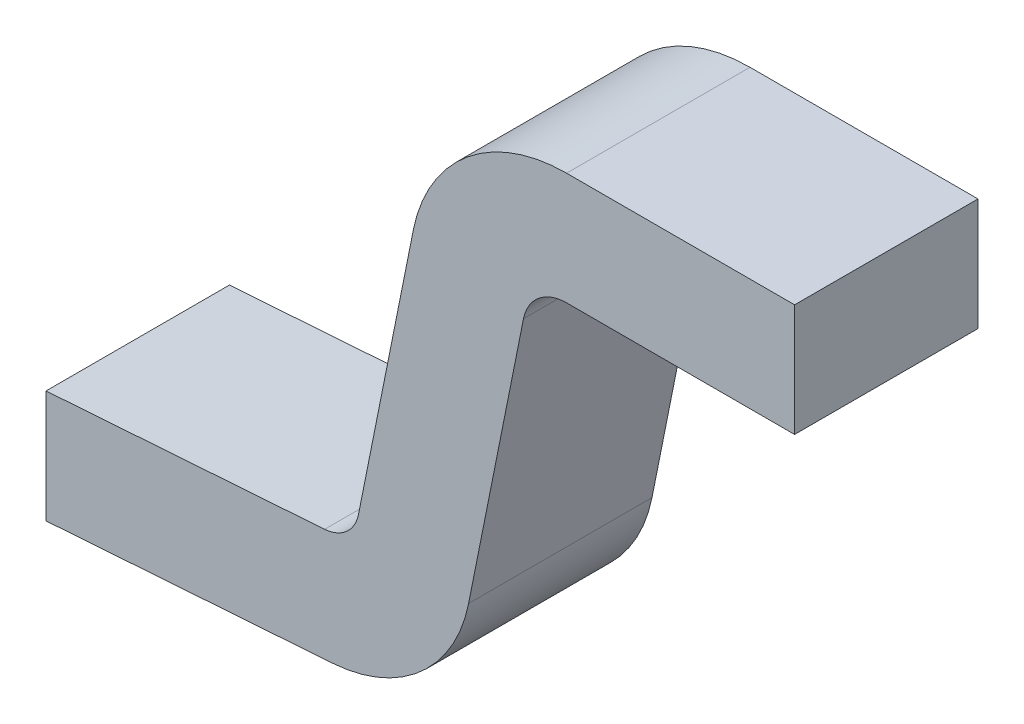
ISO-10303-21;
HEADER;
FILE_DESCRIPTION(('STEP AP214'),'2;1');
FILE_NAME('part.step','',(''),(''),'','','');
FILE_SCHEMA(('AUTOMOTIVE_DESIGN { 1 0 10303 214 1 1 1 1 }'));
ENDSEC;
DATA;
#1=APPLICATION_CONTEXT('core data for automotive mechanical design processes');
#2=APPLICATION_PROTOCOL_DEFINITION('international standard','automotive_design',2000,#1);
#3=PRODUCT_CONTEXT('',#1,'mechanical');
#4=PRODUCT('Part','Part','',(#3));
#5=PRODUCT_RELATED_PRODUCT_CATEGORY('part','',(#4));
#6=PRODUCT_DEFINITION_FORMATION('','',#4);
#7=PRODUCT_DEFINITION_CONTEXT('part definition',#1,'design');
#8=PRODUCT_DEFINITION('design','',#6,#7);
#9=PRODUCT_DEFINITION_SHAPE('','',#8);
#10=(LENGTH_UNIT() NAMED_UNIT(*) SI_UNIT(.MILLI.,.METRE.));
#11=(NAMED_UNIT(*) PLANE_ANGLE_UNIT() SI_UNIT($,.RADIAN.));
#12=(NAMED_UNIT(*) SI_UNIT($,.STERADIAN.) SOLID_ANGLE_UNIT());
#13=UNCERTAINTY_MEASURE_WITH_UNIT(LENGTH_MEASURE(1.E-05),#10,'distance_accuracy_value','');
#14=(GEOMETRIC_REPRESENTATION_CONTEXT(3) GLOBAL_UNCERTAINTY_ASSIGNED_CONTEXT((#13)) GLOBAL_UNIT_ASSIGNED_CONTEXT((#10,
#11,#12)) REPRESENTATION_CONTEXT('',''));
#15=CARTESIAN_POINT('',(0.,0.,0.));
#16=DIRECTION('',(0.,0.,1.));
#17=DIRECTION('',(1.,0.,0.));
#18=AXIS2_PLACEMENT_3D('',#15,#16,#17);
#19=CARTESIAN_POINT('',(-0.127804391765579,-0.198607262984615,0.));
#20=DIRECTION('',(-0.069756473744126,0.997564050259824,0.));
#21=DIRECTION('',(-0.997564050259824,-0.069756473744126,0.));
#22=AXIS2_PLACEMENT_3D('',#19,#20,#21);
#23=PLANE('',#22);
#24=DIRECTION('',(-0.997564050259824,-0.069756473744126,0.));
#25=VECTOR('',#24,1.);
#26=CARTESIAN_POINT('',(-0.127804391765579,-0.198607262984615,0.));
#27=LINE('',#26,#25);
#28=CARTESIAN_POINT('',(-0.127804391765579,-0.198607262984615,0.));
#29=VERTEX_POINT('',#28);
#30=CARTESIAN_POINT('',(-0.5,-0.224633715287824,0.));
#31=VERTEX_POINT('',#30);
#32=EDGE_CURVE('E11',#29,#31,#27,.T.);
#33=ORIENTED_EDGE('',*,*,#32,.T.);
#34=DIRECTION('',(0.,0.,1.));
#35=VECTOR('',#34,1.);
#36=CARTESIAN_POINT('',(-0.5,-0.224633715287824,0.));
#37=LINE('',#36,#35);
#38=CARTESIAN_POINT('',(-0.5,-0.224633715287824,0.245));
#39=VERTEX_POINT('',#38);
#40=EDGE_CURVE('E23',#31,#39,#37,.T.);
#41=ORIENTED_EDGE('',*,*,#40,.T.);
#42=DIRECTION('',(-0.997564050259824,-0.069756473744126,0.));
#43=VECTOR('',#42,1.);
#44=CARTESIAN_POINT('',(-0.127804391765579,-0.198607262984615,0.245));
#45=LINE('',#44,#43);
#46=CARTESIAN_POINT('',(-0.127804391765579,-0.198607262984615,0.245));
#47=VERTEX_POINT('',#46);
#48=EDGE_CURVE('E205',#47,#39,#45,.T.);
#49=ORIENTED_EDGE('',*,*,#48,.F.);
#50=DIRECTION('',(0.,0.,1.));
#51=VECTOR('',#50,1.);
#52=CARTESIAN_POINT('',(-0.127804391765579,-0.198607262984615,0.));
#53=LINE('',#52,#51);
#54=EDGE_CURVE('E202',#29,#47,#53,.T.);
#55=ORIENTED_EDGE('',*,*,#54,.F.);
#56=EDGE_LOOP('',(#33,#41,#49,#55));
#57=FACE_BOUND('',#56,.T.);
#58=ADVANCED_FACE('F16',(#57),#23,.T.);
#59=CARTESIAN_POINT('',(-0.131269254830082,-0.149057412673945,0.));
#60=DIRECTION('',(0.,0.,1.));
#61=DIRECTION('',(-0.069756473744126,0.997564050259824,0.));
#62=AXIS2_PLACEMENT_3D('',#59,#60,#61);
#63=CYLINDRICAL_SURFACE('',#62,0.0496708459950664);
#64=CARTESIAN_POINT('',(-0.131269254830082,-0.149057412673945,0.));
#65=DIRECTION('',(0.,0.,-1.));
#66=DIRECTION('',(-0.069756473744126,0.997564050259824,0.));
#67=AXIS2_PLACEMENT_3D('',#64,#65,#66);
#68=CIRCLE('',#67,0.0496708459950664);
#69=CARTESIAN_POINT('',(-0.0825658942513528,-0.158813211472806,0.));
#70=VERTEX_POINT('',#69);
#71=EDGE_CURVE('E199',#70,#29,#68,.T.);
#72=ORIENTED_EDGE('',*,*,#71,.T.);
#73=ORIENTED_EDGE('',*,*,#54,.T.);
#74=CARTESIAN_POINT('',(-0.131269254830082,-0.149057412673945,0.245));
#75=DIRECTION('',(0.,0.,-1.));
#76=DIRECTION('',(-0.069756473744126,0.997564050259824,0.));
#77=AXIS2_PLACEMENT_3D('',#74,#75,#76);
#78=CIRCLE('',#77,0.0496708459950664);
#79=CARTESIAN_POINT('',(-0.0825658942513528,-0.158813211472806,0.245));
#80=VERTEX_POINT('',#79);
#81=EDGE_CURVE('E196',#80,#47,#78,.T.);
#82=ORIENTED_EDGE('',*,*,#81,.F.);
#83=DIRECTION('',(0.,0.,1.));
#84=VECTOR('',#83,1.);
#85=CARTESIAN_POINT('',(-0.0825658942513528,-0.158813211472806,0.));
#86=LINE('',#85,#84);
#87=EDGE_CURVE('E194',#70,#80,#86,.T.);
#88=ORIENTED_EDGE('',*,*,#87,.F.);
#89=EDGE_LOOP('',(#72,#73,#82,#88));
#90=FACE_BOUND('',#89,.T.);
#91=ADVANCED_FACE('F234',(#90),#63,.F.);
#92=CARTESIAN_POINT('',(-0.00923430841156182,0.207276202690008,0.));
#93=DIRECTION('',(-0.980522066879372,0.196408951839279,0.));
#94=DIRECTION('',(-0.196408951839279,-0.980522066879372,0.));
#95=AXIS2_PLACEMENT_3D('',#92,#93,#94);
#96=PLANE('',#95);
#97=DIRECTION('',(-0.196408951839279,-0.980522066879372,0.));
#98=VECTOR('',#97,1.);
#99=CARTESIAN_POINT('',(-0.00923430841156182,0.207276202690008,0.));
#100=LINE('',#99,#98);
#101=CARTESIAN_POINT('',(-0.00923430841156182,0.207276202690008,0.));
#102=VERTEX_POINT('',#101);
#103=EDGE_CURVE('E191',#102,#70,#100,.T.);
#104=ORIENTED_EDGE('',*,*,#103,.T.);
#105=ORIENTED_EDGE('',*,*,#87,.T.);
#106=DIRECTION('',(-0.196408951839279,-0.980522066879372,0.));
#107=VECTOR('',#106,1.);
#108=CARTESIAN_POINT('',(-0.00923430841156182,0.207276202690008,0.245));
#109=LINE('',#108,#107);
#110=CARTESIAN_POINT('',(-0.00923430841156182,0.207276202690008,0.245));
#111=VERTEX_POINT('',#110);
#112=EDGE_CURVE('E188',#111,#80,#109,.T.);
#113=ORIENTED_EDGE('',*,*,#112,.F.);
#114=DIRECTION('',(0.,0.,1.));
#115=VECTOR('',#114,1.);
#116=CARTESIAN_POINT('',(-0.00923430841156182,0.207276202690008,0.));
#117=LINE('',#116,#115);
#118=EDGE_CURVE('E185',#102,#111,#117,.T.);
#119=ORIENTED_EDGE('',*,*,#118,.F.);
#120=EDGE_LOOP('',(#104,#105,#113,#119));
#121=FACE_BOUND('',#120,.T.);
#122=ADVANCED_FACE('F232',(#121),#96,.T.);
#123=CARTESIAN_POINT('',(0.195418151044853,0.166282148184849,0.));
#124=DIRECTION('',(0.,0.,1.));
#125=DIRECTION('',(0.,1.,0.));
#126=AXIS2_PLACEMENT_3D('',#123,#124,#125);
#127=CYLINDRICAL_SURFACE('',#126,0.208717851815151);
#128=CARTESIAN_POINT('',(0.195418151044853,0.166282148184849,0.));
#129=DIRECTION('',(0.,0.,1.));
#130=DIRECTION('',(0.,1.,0.));
#131=AXIS2_PLACEMENT_3D('',#128,#129,#130);
#132=CIRCLE('',#131,0.208717851815151);
#133=CARTESIAN_POINT('',(0.195418151044853,0.375,0.));
#134=VERTEX_POINT('',#133);
#135=EDGE_CURVE('E182',#134,#102,#132,.T.);
#136=ORIENTED_EDGE('',*,*,#135,.T.);
#137=ORIENTED_EDGE('',*,*,#118,.T.);
#138=CARTESIAN_POINT('',(0.195418151044853,0.166282148184849,0.245));
#139=DIRECTION('',(0.,0.,1.));
#140=DIRECTION('',(0.,1.,0.));
#141=AXIS2_PLACEMENT_3D('',#138,#139,#140);
#142=CIRCLE('',#141,0.208717851815151);
#143=CARTESIAN_POINT('',(0.195418151044853,0.375,0.245));
#144=VERTEX_POINT('',#143);
#145=EDGE_CURVE('E179',#144,#111,#142,.T.);
#146=ORIENTED_EDGE('',*,*,#145,.F.);
#147=DIRECTION('',(0.,0.,1.));
#148=VECTOR('',#147,1.);
#149=CARTESIAN_POINT('',(0.195418151044853,0.375,0.));
#150=LINE('',#149,#148);
#151=EDGE_CURVE('E176',#134,#144,#150,.T.);
#152=ORIENTED_EDGE('',*,*,#151,.F.);
#153=EDGE_LOOP('',(#136,#137,#146,#152));
#154=FACE_BOUND('',#153,.T.);
#155=ADVANCED_FACE('F229',(#154),#127,.T.);
#156=CARTESIAN_POINT('',(0.195418151044853,0.166282148184849,0.));
#157=DIRECTION('',(0.,0.,1.));
#158=DIRECTION('',(0.,-1.,0.));
#159=AXIS2_PLACEMENT_3D('',#156,#157,#158);
#160=CYLINDRICAL_SURFACE('',#159,0.0587178518151513);
#161=CARTESIAN_POINT('',(0.195418151044853,0.166282148184849,0.));
#162=DIRECTION('',(0.,0.,-1.));
#163=DIRECTION('',(0.,-1.,0.));
#164=AXIS2_PLACEMENT_3D('',#161,#162,#163);
#165=CIRCLE('',#164,0.0587178518151513);
#166=CARTESIAN_POINT('',(0.137844001620344,0.177814859914117,0.));
#167=VERTEX_POINT('',#166);
#168=CARTESIAN_POINT('',(0.195418151044853,0.225,0.));
#169=VERTEX_POINT('',#168);
#170=EDGE_CURVE('E173',#167,#169,#165,.T.);
#171=ORIENTED_EDGE('',*,*,#170,.T.);
#172=DIRECTION('',(0.,0.,1.));
#173=VECTOR('',#172,1.);
#174=CARTESIAN_POINT('',(0.195418151044853,0.225,0.));
#175=LINE('',#174,#173);
#176=CARTESIAN_POINT('',(0.195418151044853,0.225,0.245));
#177=VERTEX_POINT('',#176);
#178=EDGE_CURVE('E171',#169,#177,#175,.T.);
#179=ORIENTED_EDGE('',*,*,#178,.T.);
#180=CARTESIAN_POINT('',(0.195418151044853,0.166282148184849,0.245));
#181=DIRECTION('',(0.,0.,-1.));
#182=DIRECTION('',(0.,-1.,0.));
#183=AXIS2_PLACEMENT_3D('',#180,#181,#182);
#184=CIRCLE('',#183,0.0587178518151513);
#185=CARTESIAN_POINT('',(0.137844001620344,0.177814859914117,0.245));
#186=VERTEX_POINT('',#185);
#187=EDGE_CURVE('E123',#186,#177,#184,.T.);
#188=ORIENTED_EDGE('',*,*,#187,.F.);
#189=DIRECTION('',(0.,0.,1.));
#190=VECTOR('',#189,1.);
#191=CARTESIAN_POINT('',(0.137844001620344,0.177814859914117,0.));
#192=LINE('',#191,#190);
#193=EDGE_CURVE('E168',#167,#186,#192,.T.);
#194=ORIENTED_EDGE('',*,*,#193,.F.);
#195=EDGE_LOOP('',(#171,#179,#188,#194));
#196=FACE_BOUND('',#195,.T.);
#197=ADVANCED_FACE('F222',(#196),#160,.F.);
#198=CARTESIAN_POINT('',(0.0645124157805532,-0.188274554248698,0.));
#199=DIRECTION('',(0.980522066879372,-0.196408951839279,0.));
#200=DIRECTION('',(0.196408951839279,0.980522066879372,0.));
#201=AXIS2_PLACEMENT_3D('',#198,#199,#200);
#202=PLANE('',#201);
#203=DIRECTION('',(0.196408951839278,0.980522066879372,0.));
#204=VECTOR('',#203,1.);
#205=CARTESIAN_POINT('',(0.0645124157805532,-0.188274554248698,0.));
#206=LINE('',#205,#204);
#207=CARTESIAN_POINT('',(0.0645124157805532,-0.188274554248698,0.));
#208=VERTEX_POINT('',#207);
#209=EDGE_CURVE('E165',#208,#167,#206,.T.);
#210=ORIENTED_EDGE('',*,*,#209,.T.);
#211=ORIENTED_EDGE('',*,*,#193,.T.);
#212=DIRECTION('',(0.196408951839278,0.980522066879372,0.));
#213=VECTOR('',#212,1.);
#214=CARTESIAN_POINT('',(0.0645124157805532,-0.188274554248698,0.245));
#215=LINE('',#214,#213);
#216=CARTESIAN_POINT('',(0.0645124157805532,-0.188274554248698,0.245));
#217=VERTEX_POINT('',#216);
#218=EDGE_CURVE('E163',#217,#186,#215,.T.);
#219=ORIENTED_EDGE('',*,*,#218,.F.);
#220=DIRECTION('',(0.,0.,1.));
#221=VECTOR('',#220,1.);
#222=CARTESIAN_POINT('',(0.0645124157805532,-0.188274554248698,0.));
#223=LINE('',#222,#221);
#224=EDGE_CURVE('E160',#208,#217,#223,.T.);
#225=ORIENTED_EDGE('',*,*,#224,.F.);
#226=EDGE_LOOP('',(#210,#211,#219,#225));
#227=FACE_BOUND('',#226,.T.);
#228=ADVANCED_FACE('F219',(#227),#202,.T.);
#229=CARTESIAN_POINT('',(-0.131269254830082,-0.149057412673945,0.));
#230=DIRECTION('',(0.,0.,1.));
#231=DIRECTION('',(0.069756473744126,-0.997564050259824,0.));
#232=AXIS2_PLACEMENT_3D('',#229,#230,#231);
#233=CYLINDRICAL_SURFACE('',#232,0.199670845995066);
#234=CARTESIAN_POINT('',(-0.131269254830082,-0.149057412673945,0.));
#235=DIRECTION('',(0.,0.,1.));
#236=DIRECTION('',(0.069756473744126,-0.997564050259824,0.));
#237=AXIS2_PLACEMENT_3D('',#234,#235,#236);
#238=CIRCLE('',#237,0.199670845995066);
#239=CARTESIAN_POINT('',(-0.11734092070396,-0.348241870523589,0.));
#240=VERTEX_POINT('',#239);
#241=EDGE_CURVE('E157',#240,#208,#238,.T.);
#242=ORIENTED_EDGE('',*,*,#241,.T.);
#243=ORIENTED_EDGE('',*,*,#224,.T.);
#244=CARTESIAN_POINT('',(-0.131269254830082,-0.149057412673945,0.245));
#245=DIRECTION('',(0.,0.,1.));
#246=DIRECTION('',(0.069756473744126,-0.997564050259824,0.));
#247=AXIS2_PLACEMENT_3D('',#244,#245,#246);
#248=CIRCLE('',#247,0.199670845995066);
#249=CARTESIAN_POINT('',(-0.11734092070396,-0.348241870523589,0.245));
#250=VERTEX_POINT('',#249);
#251=EDGE_CURVE('E154',#250,#217,#248,.T.);
#252=ORIENTED_EDGE('',*,*,#251,.F.);
#253=DIRECTION('',(0.,0.,1.));
#254=VECTOR('',#253,1.);
#255=CARTESIAN_POINT('',(-0.11734092070396,-0.348241870523589,0.));
#256=LINE('',#255,#254);
#257=EDGE_CURVE('E151',#240,#250,#256,.T.);
#258=ORIENTED_EDGE('',*,*,#257,.F.);
#259=EDGE_LOOP('',(#242,#243,#252,#258));
#260=FACE_BOUND('',#259,.T.);
#261=ADVANCED_FACE('F216',(#260),#233,.T.);
#262=CARTESIAN_POINT('',(-0.5,-0.375,0.));
#263=DIRECTION('',(0.069756473744126,-0.997564050259824,0.));
#264=DIRECTION('',(0.997564050259824,0.069756473744126,0.));
#265=AXIS2_PLACEMENT_3D('',#262,#263,#264);
#266=PLANE('',#265);
#267=DIRECTION('',(0.997564050259824,0.069756473744126,0.));
#268=VECTOR('',#267,1.);
#269=CARTESIAN_POINT('',(-0.5,-0.375,0.));
#270=LINE('',#269,#268);
#271=CARTESIAN_POINT('',(-0.5,-0.375,0.));
#272=VERTEX_POINT('',#271);
#273=EDGE_CURVE('E148',#272,#240,#270,.T.);
#274=ORIENTED_EDGE('',*,*,#273,.T.);
#275=ORIENTED_EDGE('',*,*,#257,.T.);
#276=DIRECTION('',(0.997564050259824,0.069756473744126,0.));
#277=VECTOR('',#276,1.);
#278=CARTESIAN_POINT('',(-0.5,-0.375,0.245));
#279=LINE('',#278,#277);
#280=CARTESIAN_POINT('',(-0.5,-0.375,0.245));
#281=VERTEX_POINT('',#280);
#282=EDGE_CURVE('E145',#281,#250,#279,.T.);
#283=ORIENTED_EDGE('',*,*,#282,.F.);
#284=DIRECTION('',(0.,0.,1.));
#285=VECTOR('',#284,1.);
#286=CARTESIAN_POINT('',(-0.5,-0.375,0.));
#287=LINE('',#286,#285);
#288=EDGE_CURVE('E142',#272,#281,#287,.T.);
#289=ORIENTED_EDGE('',*,*,#288,.F.);
#290=EDGE_LOOP('',(#274,#275,#283,#289));
#291=FACE_BOUND('',#290,.T.);
#292=ADVANCED_FACE('F213',(#291),#266,.T.);
#293=CARTESIAN_POINT('',(-0.5,-0.224633715287824,0.));
#294=DIRECTION('',(-1.,0.,0.));
#295=DIRECTION('',(0.,-1.,0.));
#296=AXIS2_PLACEMENT_3D('',#293,#294,#295);
#297=PLANE('',#296);
#298=DIRECTION('',(0.,-1.,0.));
#299=VECTOR('',#298,1.);
#300=CARTESIAN_POINT('',(-0.5,0.375,0.));
#301=LINE('',#300,#299);
#302=EDGE_CURVE('E139',#31,#272,#301,.T.);
#303=ORIENTED_EDGE('',*,*,#302,.T.);
#304=ORIENTED_EDGE('',*,*,#288,.T.);
#305=DIRECTION('',(0.,-1.,0.));
#306=VECTOR('',#305,1.);
#307=CARTESIAN_POINT('',(-0.5,0.375,0.245));
#308=LINE('',#307,#306);
#309=EDGE_CURVE('E136',#39,#281,#308,.T.);
#310=ORIENTED_EDGE('',*,*,#309,.F.);
#311=ORIENTED_EDGE('',*,*,#40,.F.);
#312=EDGE_LOOP('',(#303,#304,#310,#311));
#313=FACE_BOUND('',#312,.T.);
#314=ADVANCED_FACE('F210',(#313),#297,.T.);
#315=CARTESIAN_POINT('',(0.5,0.225,0.));
#316=DIRECTION('',(1.,0.,0.));
#317=DIRECTION('',(0.,1.,0.));
#318=AXIS2_PLACEMENT_3D('',#315,#316,#317);
#319=PLANE('',#318);
#320=DIRECTION('',(0.,1.,0.));
#321=VECTOR('',#320,1.);
#322=CARTESIAN_POINT('',(0.5,0.225,0.));
#323=LINE('',#322,#321);
#324=CARTESIAN_POINT('',(0.5,0.225,0.));
#325=VERTEX_POINT('',#324);
#326=CARTESIAN_POINT('',(0.5,0.375,0.));
#327=VERTEX_POINT('',#326);
#328=EDGE_CURVE('E134',#325,#327,#323,.T.);
#329=ORIENTED_EDGE('',*,*,#328,.T.);
#330=DIRECTION('',(0.,0.,1.));
#331=VECTOR('',#330,1.);
#332=CARTESIAN_POINT('',(0.5,0.375,0.));
#333=LINE('',#332,#331);
#334=CARTESIAN_POINT('',(0.5,0.375,0.245));
#335=VERTEX_POINT('',#334);
#336=EDGE_CURVE('E107',#327,#335,#333,.T.);
#337=ORIENTED_EDGE('',*,*,#336,.T.);
#338=DIRECTION('',(0.,1.,0.));
#339=VECTOR('',#338,1.);
#340=CARTESIAN_POINT('',(0.5,0.225,0.245));
#341=LINE('',#340,#339);
#342=CARTESIAN_POINT('',(0.5,0.225,0.245));
#343=VERTEX_POINT('',#342);
#344=EDGE_CURVE('E101',#343,#335,#341,.T.);
#345=ORIENTED_EDGE('',*,*,#344,.F.);
#346=DIRECTION('',(0.,0.,1.));
#347=VECTOR('',#346,1.);
#348=CARTESIAN_POINT('',(0.5,0.225,0.));
#349=LINE('',#348,#347);
#350=EDGE_CURVE('E104',#325,#343,#349,.T.);
#351=ORIENTED_EDGE('',*,*,#350,.F.);
#352=EDGE_LOOP('',(#329,#337,#345,#351));
#353=FACE_BOUND('',#352,.T.);
#354=ADVANCED_FACE('F103',(#353),#319,.T.);
#355=CARTESIAN_POINT('',(0.195418151044853,0.225,0.));
#356=DIRECTION('',(0.,-1.,0.));
#357=DIRECTION('',(1.,0.,0.));
#358=AXIS2_PLACEMENT_3D('',#355,#356,#357);
#359=PLANE('',#358);
#360=DIRECTION('',(1.,0.,0.));
#361=VECTOR('',#360,1.);
#362=CARTESIAN_POINT('',(0.195418151044853,0.225,0.));
#363=LINE('',#362,#361);
#364=EDGE_CURVE('E118',#169,#325,#363,.T.);
#365=ORIENTED_EDGE('',*,*,#364,.T.);
#366=ORIENTED_EDGE('',*,*,#350,.T.);
#367=DIRECTION('',(1.,0.,0.));
#368=VECTOR('',#367,1.);
#369=CARTESIAN_POINT('',(0.195418151044853,0.225,0.245));
#370=LINE('',#369,#368);
#371=EDGE_CURVE('E116',#177,#343,#370,.T.);
#372=ORIENTED_EDGE('',*,*,#371,.F.);
#373=ORIENTED_EDGE('',*,*,#178,.F.);
#374=EDGE_LOOP('',(#365,#366,#372,#373));
#375=FACE_BOUND('',#374,.T.);
#376=ADVANCED_FACE('F115',(#375),#359,.T.);
#377=CARTESIAN_POINT('',(0.5,0.375,0.));
#378=DIRECTION('',(0.,1.,0.));
#379=DIRECTION('',(-1.,0.,0.));
#380=AXIS2_PLACEMENT_3D('',#377,#378,#379);
#381=PLANE('',#380);
#382=DIRECTION('',(-1.,0.,0.));
#383=VECTOR('',#382,1.);
#384=CARTESIAN_POINT('',(0.5,0.375,0.));
#385=LINE('',#384,#383);
#386=EDGE_CURVE('E125',#327,#134,#385,.T.);
#387=ORIENTED_EDGE('',*,*,#386,.T.);
#388=ORIENTED_EDGE('',*,*,#151,.T.);
#389=DIRECTION('',(-1.,0.,0.));
#390=VECTOR('',#389,1.);
#391=CARTESIAN_POINT('',(0.5,0.375,0.245));
#392=LINE('',#391,#390);
#393=EDGE_CURVE('E129',#335,#144,#392,.T.);
#394=ORIENTED_EDGE('',*,*,#393,.F.);
#395=ORIENTED_EDGE('',*,*,#336,.F.);
#396=EDGE_LOOP('',(#387,#388,#394,#395));
#397=FACE_BOUND('',#396,.T.);
#398=ADVANCED_FACE('F226',(#397),#381,.T.);
#399=CARTESIAN_POINT('',(0.347709075522426,0.3,0.245));
#400=DIRECTION('',(0.,0.,1.));
#401=DIRECTION('',(1.,0.,0.));
#402=AXIS2_PLACEMENT_3D('',#399,#400,#401);
#403=PLANE('',#402);
#404=ORIENTED_EDGE('',*,*,#393,.T.);
#405=ORIENTED_EDGE('',*,*,#145,.T.);
#406=ORIENTED_EDGE('',*,*,#112,.T.);
#407=ORIENTED_EDGE('',*,*,#81,.T.);
#408=ORIENTED_EDGE('',*,*,#48,.T.);
#409=ORIENTED_EDGE('',*,*,#309,.T.);
#410=ORIENTED_EDGE('',*,*,#282,.T.);
#411=ORIENTED_EDGE('',*,*,#251,.T.);
#412=ORIENTED_EDGE('',*,*,#218,.T.);
#413=ORIENTED_EDGE('',*,*,#187,.T.);
#414=ORIENTED_EDGE('',*,*,#371,.T.);
#415=ORIENTED_EDGE('',*,*,#344,.T.);
#416=EDGE_LOOP('',(#404,#405,#406,#407,#408,#409,#410,#411,#412,#413,#414,#415));
#417=FACE_BOUND('',#416,.T.);
#418=ADVANCED_FACE('F120',(#417),#403,.T.);
#419=CARTESIAN_POINT('',(0.347709075522426,0.3,0.));
#420=DIRECTION('',(0.,0.,1.));
#421=DIRECTION('',(1.,0.,0.));
#422=AXIS2_PLACEMENT_3D('',#419,#420,#421);
#423=PLANE('',#422);
#424=ORIENTED_EDGE('',*,*,#386,.F.);
#425=ORIENTED_EDGE('',*,*,#328,.F.);
#426=ORIENTED_EDGE('',*,*,#364,.F.);
#427=ORIENTED_EDGE('',*,*,#170,.F.);
#428=ORIENTED_EDGE('',*,*,#209,.F.);
#429=ORIENTED_EDGE('',*,*,#241,.F.);
#430=ORIENTED_EDGE('',*,*,#273,.F.);
#431=ORIENTED_EDGE('',*,*,#302,.F.);
#432=ORIENTED_EDGE('',*,*,#32,.F.);
#433=ORIENTED_EDGE('',*,*,#71,.F.);
#434=ORIENTED_EDGE('',*,*,#103,.F.);
#435=ORIENTED_EDGE('',*,*,#135,.F.);
#436=EDGE_LOOP('',(#424,#425,#426,#427,#428,#429,#430,#431,#432,#433,#434,#435));
#437=FACE_BOUND('',#436,.T.);
#438=ADVANCED_FACE('F224',(#437),#423,.F.);
#439=CLOSED_SHELL('',(#58,#91,#122,#155,#197,#228,#261,#292,#314,#354,#376,#398,#418,#438));
#440=MANIFOLD_SOLID_BREP('B1',#439);
#441=ADVANCED_BREP_SHAPE_REPRESENTATION('',(#18,#440),#14);
#442=SHAPE_DEFINITION_REPRESENTATION(#9,#441);
ENDSEC;
END-ISO-10303-21;
